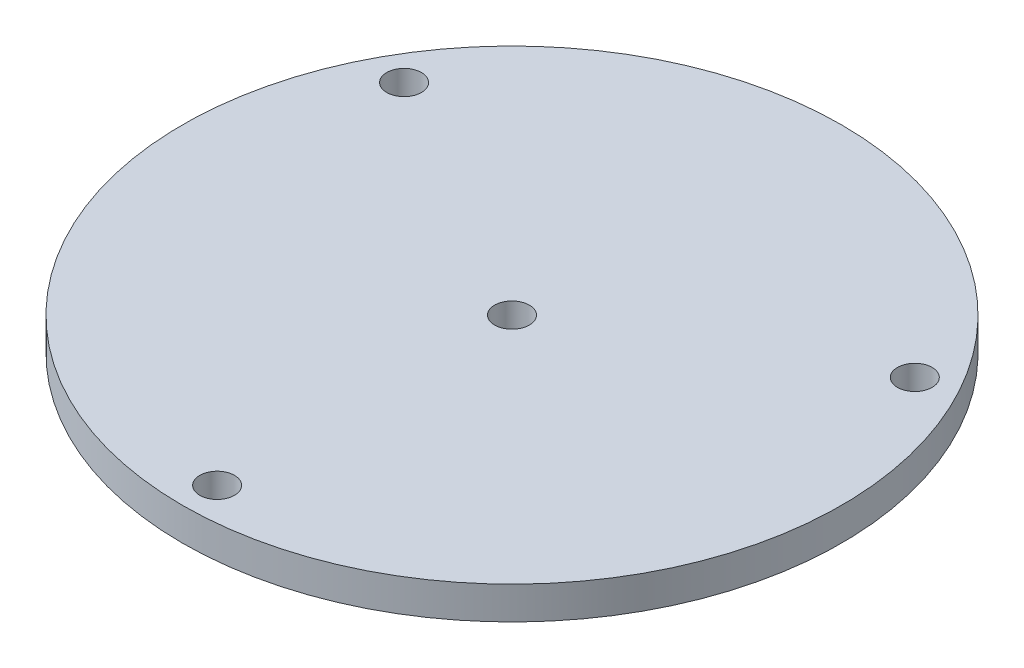
ISO-10303-21;
HEADER;
FILE_DESCRIPTION(('STEP AP214'),'2;1');
FILE_NAME('part.step','',(''),(''),'','','');
FILE_SCHEMA(('AUTOMOTIVE_DESIGN { 1 0 10303 214 1 1 1 1 }'));
ENDSEC;
DATA;
#1=APPLICATION_CONTEXT('core data for automotive mechanical design processes');
#2=APPLICATION_PROTOCOL_DEFINITION('international standard','automotive_design',2000,#1);
#3=PRODUCT_CONTEXT('',#1,'mechanical');
#4=PRODUCT('Part','Part','',(#3));
#5=PRODUCT_RELATED_PRODUCT_CATEGORY('part','',(#4));
#6=PRODUCT_DEFINITION_FORMATION('','',#4);
#7=PRODUCT_DEFINITION_CONTEXT('part definition',#1,'design');
#8=PRODUCT_DEFINITION('design','',#6,#7);
#9=PRODUCT_DEFINITION_SHAPE('','',#8);
#10=(LENGTH_UNIT() NAMED_UNIT(*) SI_UNIT(.MILLI.,.METRE.));
#11=(NAMED_UNIT(*) PLANE_ANGLE_UNIT() SI_UNIT($,.RADIAN.));
#12=(NAMED_UNIT(*) SI_UNIT($,.STERADIAN.) SOLID_ANGLE_UNIT());
#13=UNCERTAINTY_MEASURE_WITH_UNIT(LENGTH_MEASURE(1.E-05),#10,'distance_accuracy_value','');
#14=(GEOMETRIC_REPRESENTATION_CONTEXT(3) GLOBAL_UNCERTAINTY_ASSIGNED_CONTEXT((#13)) GLOBAL_UNIT_ASSIGNED_CONTEXT((#10,
#11,#12)) REPRESENTATION_CONTEXT('',''));
#15=CARTESIAN_POINT('',(0.,0.,0.));
#16=DIRECTION('',(0.,0.,1.));
#17=DIRECTION('',(1.,0.,0.));
#18=AXIS2_PLACEMENT_3D('',#15,#16,#17);
#19=CARTESIAN_POINT('',(0.,6.,0.));
#20=DIRECTION('',(0.,1.,0.));
#21=DIRECTION('',(0.,0.,1.));
#22=AXIS2_PLACEMENT_3D('',#19,#20,#21);
#23=PLANE('',#22);
#24=CARTESIAN_POINT('',(46.7657182145212,6.,-27.0002));
#25=DIRECTION('',(0.,1.,0.));
#26=DIRECTION('',(0.,0.,1.));
#27=AXIS2_PLACEMENT_3D('',#24,#25,#26);
#28=CIRCLE('',#27,3.17499999999999);
#29=CARTESIAN_POINT('',(46.7657182145212,6.,-23.8252));
#30=VERTEX_POINT('',#29);
#31=EDGE_CURVE('E89',#30,#30,#28,.T.);
#32=ORIENTED_EDGE('',*,*,#31,.F.);
#33=EDGE_LOOP('',(#32));
#34=FACE_BOUND('',#33,.T.);
#35=CARTESIAN_POINT('',(0.,6.,0.));
#36=DIRECTION('',(0.,1.,0.));
#37=DIRECTION('',(0.,0.,1.));
#38=AXIS2_PLACEMENT_3D('',#35,#36,#37);
#39=CIRCLE('',#38,3.175);
#40=CARTESIAN_POINT('',(0.,6.,3.175));
#41=VERTEX_POINT('',#40);
#42=EDGE_CURVE('E78',#41,#41,#39,.T.);
#43=ORIENTED_EDGE('',*,*,#42,.F.);
#44=EDGE_LOOP('',(#43));
#45=FACE_BOUND('',#44,.T.);
#46=CARTESIAN_POINT('',(0.,6.,0.));
#47=DIRECTION('',(0.,1.,0.));
#48=DIRECTION('',(0.,0.,1.));
#49=AXIS2_PLACEMENT_3D('',#46,#47,#48);
#50=CIRCLE('',#49,60.3504);
#51=CARTESIAN_POINT('',(0.,6.,60.3504));
#52=VERTEX_POINT('',#51);
#53=EDGE_CURVE('E11',#52,#52,#50,.T.);
#54=ORIENTED_EDGE('',*,*,#53,.T.);
#55=EDGE_LOOP('',(#54));
#56=FACE_BOUND('',#55,.T.);
#57=CARTESIAN_POINT('',(0.,6.,54.0004));
#58=DIRECTION('',(0.,1.,0.));
#59=DIRECTION('',(0.,0.,1.));
#60=AXIS2_PLACEMENT_3D('',#57,#58,#59);
#61=CIRCLE('',#60,3.175);
#62=CARTESIAN_POINT('',(0.,6.,57.1754));
#63=VERTEX_POINT('',#62);
#64=EDGE_CURVE('E83',#63,#63,#61,.T.);
#65=ORIENTED_EDGE('',*,*,#64,.F.);
#66=EDGE_LOOP('',(#65));
#67=FACE_BOUND('',#66,.T.);
#68=CARTESIAN_POINT('',(-46.7657182145212,6.,-27.0002));
#69=DIRECTION('',(0.,1.,0.));
#70=DIRECTION('',(0.,0.,1.));
#71=AXIS2_PLACEMENT_3D('',#68,#69,#70);
#72=CIRCLE('',#71,3.175);
#73=CARTESIAN_POINT('',(-46.7657182145212,6.,-23.8252));
#74=VERTEX_POINT('',#73);
#75=EDGE_CURVE('E95',#74,#74,#72,.T.);
#76=ORIENTED_EDGE('',*,*,#75,.F.);
#77=EDGE_LOOP('',(#76));
#78=FACE_BOUND('',#77,.T.);
#79=ADVANCED_FACE('F67',(#34,#45,#56,#67,#78),#23,.T.);
#80=CARTESIAN_POINT('',(0.,0.,0.));
#81=DIRECTION('',(0.,1.,0.));
#82=DIRECTION('',(0.,0.,1.));
#83=AXIS2_PLACEMENT_3D('',#80,#81,#82);
#84=PLANE('',#83);
#85=CARTESIAN_POINT('',(0.,0.,0.));
#86=DIRECTION('',(0.,1.,0.));
#87=DIRECTION('',(0.,0.,1.));
#88=AXIS2_PLACEMENT_3D('',#85,#86,#87);
#89=CIRCLE('',#88,60.3504);
#90=CARTESIAN_POINT('',(0.,0.,60.3504));
#91=VERTEX_POINT('',#90);
#92=EDGE_CURVE('E71',#91,#91,#89,.T.);
#93=ORIENTED_EDGE('',*,*,#92,.F.);
#94=EDGE_LOOP('',(#93));
#95=FACE_BOUND('',#94,.T.);
#96=CARTESIAN_POINT('',(0.,0.,0.));
#97=DIRECTION('',(0.,1.,0.));
#98=DIRECTION('',(0.,0.,1.));
#99=AXIS2_PLACEMENT_3D('',#96,#97,#98);
#100=CIRCLE('',#99,3.175);
#101=CARTESIAN_POINT('',(0.,0.,3.175));
#102=VERTEX_POINT('',#101);
#103=EDGE_CURVE('E80',#102,#102,#100,.T.);
#104=ORIENTED_EDGE('',*,*,#103,.T.);
#105=EDGE_LOOP('',(#104));
#106=FACE_BOUND('',#105,.T.);
#107=CARTESIAN_POINT('',(0.,0.,54.0004));
#108=DIRECTION('',(0.,1.,0.));
#109=DIRECTION('',(0.,0.,1.));
#110=AXIS2_PLACEMENT_3D('',#107,#108,#109);
#111=CIRCLE('',#110,3.175);
#112=CARTESIAN_POINT('',(0.,0.,57.1754));
#113=VERTEX_POINT('',#112);
#114=EDGE_CURVE('E86',#113,#113,#111,.T.);
#115=ORIENTED_EDGE('',*,*,#114,.T.);
#116=EDGE_LOOP('',(#115));
#117=FACE_BOUND('',#116,.T.);
#118=CARTESIAN_POINT('',(46.7657182145212,0.,-27.0002));
#119=DIRECTION('',(0.,1.,0.));
#120=DIRECTION('',(0.,0.,1.));
#121=AXIS2_PLACEMENT_3D('',#118,#119,#120);
#122=CIRCLE('',#121,3.17499999999999);
#123=CARTESIAN_POINT('',(46.7657182145212,0.,-23.8252));
#124=VERTEX_POINT('',#123);
#125=EDGE_CURVE('E92',#124,#124,#122,.T.);
#126=ORIENTED_EDGE('',*,*,#125,.T.);
#127=EDGE_LOOP('',(#126));
#128=FACE_BOUND('',#127,.T.);
#129=CARTESIAN_POINT('',(-46.7657182145212,0.,-27.0002));
#130=DIRECTION('',(0.,1.,0.));
#131=DIRECTION('',(0.,0.,1.));
#132=AXIS2_PLACEMENT_3D('',#129,#130,#131);
#133=CIRCLE('',#132,3.175);
#134=CARTESIAN_POINT('',(-46.7657182145212,0.,-23.8252));
#135=VERTEX_POINT('',#134);
#136=EDGE_CURVE('E98',#135,#135,#133,.T.);
#137=ORIENTED_EDGE('',*,*,#136,.T.);
#138=EDGE_LOOP('',(#137));
#139=FACE_BOUND('',#138,.T.);
#140=ADVANCED_FACE('F108',(#95,#106,#117,#128,#139),#84,.F.);
#141=CARTESIAN_POINT('',(0.,6.,0.));
#142=DIRECTION('',(0.,-1.,0.));
#143=DIRECTION('',(0.,0.,-1.));
#144=AXIS2_PLACEMENT_3D('',#141,#142,#143);
#145=CYLINDRICAL_SURFACE('',#144,60.3504);
#146=ORIENTED_EDGE('',*,*,#53,.F.);
#147=EDGE_LOOP('',(#146));
#148=FACE_BOUND('',#147,.T.);
#149=ORIENTED_EDGE('',*,*,#92,.T.);
#150=EDGE_LOOP('',(#149));
#151=FACE_BOUND('',#150,.T.);
#152=ADVANCED_FACE('F69',(#148,#151),#145,.T.);
#153=CARTESIAN_POINT('',(0.,6.,0.));
#154=DIRECTION('',(0.,-1.,0.));
#155=DIRECTION('',(0.,0.,-1.));
#156=AXIS2_PLACEMENT_3D('',#153,#154,#155);
#157=CYLINDRICAL_SURFACE('',#156,3.175);
#158=ORIENTED_EDGE('',*,*,#42,.T.);
#159=EDGE_LOOP('',(#158));
#160=FACE_BOUND('',#159,.T.);
#161=ORIENTED_EDGE('',*,*,#103,.F.);
#162=EDGE_LOOP('',(#161));
#163=FACE_BOUND('',#162,.T.);
#164=ADVANCED_FACE('F118',(#160,#163),#157,.F.);
#165=CARTESIAN_POINT('',(0.,6.,54.0004));
#166=DIRECTION('',(0.,-1.,0.));
#167=DIRECTION('',(0.,0.,-1.));
#168=AXIS2_PLACEMENT_3D('',#165,#166,#167);
#169=CYLINDRICAL_SURFACE('',#168,3.175);
#170=ORIENTED_EDGE('',*,*,#64,.T.);
#171=EDGE_LOOP('',(#170));
#172=FACE_BOUND('',#171,.T.);
#173=ORIENTED_EDGE('',*,*,#114,.F.);
#174=EDGE_LOOP('',(#173));
#175=FACE_BOUND('',#174,.T.);
#176=ADVANCED_FACE('F121',(#172,#175),#169,.F.);
#177=CARTESIAN_POINT('',(46.7657182145212,6.,-27.0002));
#178=DIRECTION('',(0.,-1.,0.));
#179=DIRECTION('',(0.,0.,-1.));
#180=AXIS2_PLACEMENT_3D('',#177,#178,#179);
#181=CYLINDRICAL_SURFACE('',#180,3.17499999999999);
#182=ORIENTED_EDGE('',*,*,#31,.T.);
#183=EDGE_LOOP('',(#182));
#184=FACE_BOUND('',#183,.T.);
#185=ORIENTED_EDGE('',*,*,#125,.F.);
#186=EDGE_LOOP('',(#185));
#187=FACE_BOUND('',#186,.T.);
#188=ADVANCED_FACE('F125',(#184,#187),#181,.F.);
#189=CARTESIAN_POINT('',(-46.7657182145212,6.,-27.0002));
#190=DIRECTION('',(0.,-1.,0.));
#191=DIRECTION('',(0.,0.,-1.));
#192=AXIS2_PLACEMENT_3D('',#189,#190,#191);
#193=CYLINDRICAL_SURFACE('',#192,3.175);
#194=ORIENTED_EDGE('',*,*,#75,.T.);
#195=EDGE_LOOP('',(#194));
#196=FACE_BOUND('',#195,.T.);
#197=ORIENTED_EDGE('',*,*,#136,.F.);
#198=EDGE_LOOP('',(#197));
#199=FACE_BOUND('',#198,.T.);
#200=ADVANCED_FACE('F104',(#196,#199),#193,.F.);
#201=CLOSED_SHELL('',(#79,#140,#152,#164,#176,#188,#200));
#202=MANIFOLD_SOLID_BREP('B2',#201);
#203=ADVANCED_BREP_SHAPE_REPRESENTATION('',(#18,#202),#14);
#204=SHAPE_DEFINITION_REPRESENTATION(#9,#203);
ENDSEC;
END-ISO-10303-21;
